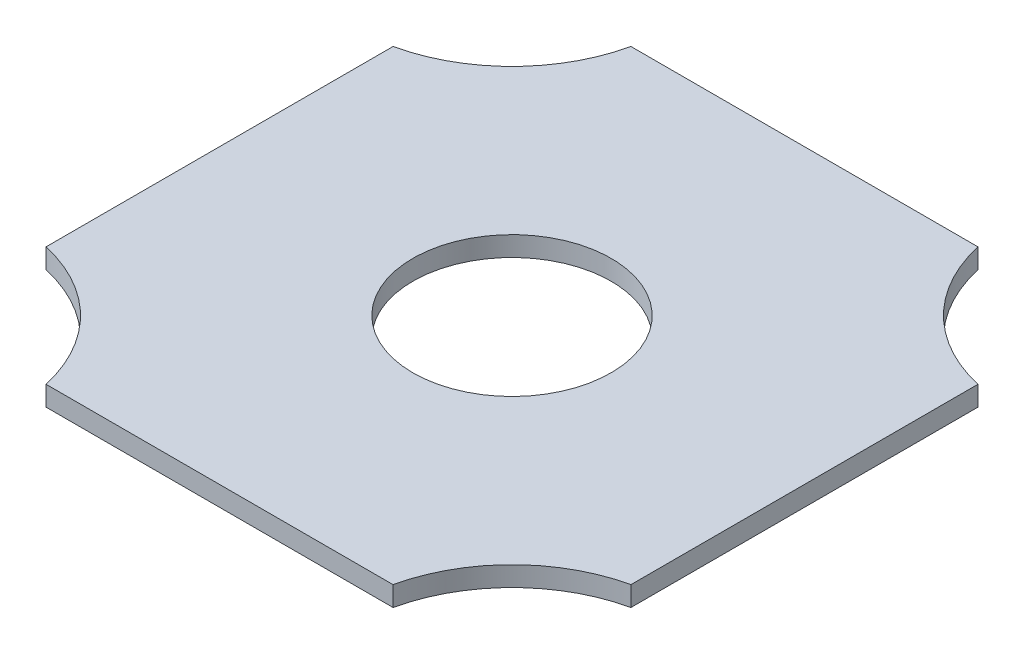
ISO-10303-21;
HEADER;
FILE_DESCRIPTION(('STEP AP214'),'2;1');
FILE_NAME('part.step','',(''),(''),'','','');
FILE_SCHEMA(('AUTOMOTIVE_DESIGN { 1 0 10303 214 1 1 1 1 }'));
ENDSEC;
DATA;
#1=APPLICATION_CONTEXT('core data for automotive mechanical design processes');
#2=APPLICATION_PROTOCOL_DEFINITION('international standard','automotive_design',2000,#1);
#3=PRODUCT_CONTEXT('',#1,'mechanical');
#4=PRODUCT('Part','Part','',(#3));
#5=PRODUCT_RELATED_PRODUCT_CATEGORY('part','',(#4));
#6=PRODUCT_DEFINITION_FORMATION('','',#4);
#7=PRODUCT_DEFINITION_CONTEXT('part definition',#1,'design');
#8=PRODUCT_DEFINITION('design','',#6,#7);
#9=PRODUCT_DEFINITION_SHAPE('','',#8);
#10=(LENGTH_UNIT() NAMED_UNIT(*) SI_UNIT(.MILLI.,.METRE.));
#11=(NAMED_UNIT(*) PLANE_ANGLE_UNIT() SI_UNIT($,.RADIAN.));
#12=(NAMED_UNIT(*) SI_UNIT($,.STERADIAN.) SOLID_ANGLE_UNIT());
#13=UNCERTAINTY_MEASURE_WITH_UNIT(LENGTH_MEASURE(1.E-05),#10,'distance_accuracy_value','');
#14=(GEOMETRIC_REPRESENTATION_CONTEXT(3) GLOBAL_UNCERTAINTY_ASSIGNED_CONTEXT((#13)) GLOBAL_UNIT_ASSIGNED_CONTEXT((#10,
#11,#12)) REPRESENTATION_CONTEXT('',''));
#15=CARTESIAN_POINT('',(0.,0.,0.));
#16=DIRECTION('',(0.,0.,1.));
#17=DIRECTION('',(1.,0.,0.));
#18=AXIS2_PLACEMENT_3D('',#15,#16,#17);
#19=CARTESIAN_POINT('',(-32.2270175622713,2.,-34.0017247818068));
#20=DIRECTION('',(0.,-1.,0.));
#21=DIRECTION('',(0.,0.,-1.));
#22=AXIS2_PLACEMENT_3D('',#19,#20,#21);
#23=CYLINDRICAL_SURFACE('',#22,15.8501875594606);
#24=CARTESIAN_POINT('',(-32.2270175622713,0.,-34.0017247818068));
#25=DIRECTION('',(0.,-1.,0.));
#26=DIRECTION('',(0.,0.,1.));
#27=AXIS2_PLACEMENT_3D('',#24,#25,#26);
#28=CIRCLE('',#27,15.8501875594606);
#29=CARTESIAN_POINT('',(-16.7605386585269,0.,-30.5352458780619));
#30=VERTEX_POINT('',#29);
#31=CARTESIAN_POINT('',(-28.760538658527,0.,-18.5352458780623));
#32=VERTEX_POINT('',#31);
#33=EDGE_CURVE('E140',#30,#32,#28,.T.);
#34=ORIENTED_EDGE('',*,*,#33,.T.);
#35=DIRECTION('',(0.,-1.,0.));
#36=VECTOR('',#35,1.);
#37=CARTESIAN_POINT('',(-28.760538658527,2.,-18.5352458780623));
#38=LINE('',#37,#36);
#39=CARTESIAN_POINT('',(-28.760538658527,2.,-18.5352458780623));
#40=VERTEX_POINT('',#39);
#41=EDGE_CURVE('E11',#40,#32,#38,.T.);
#42=ORIENTED_EDGE('',*,*,#41,.F.);
#43=CARTESIAN_POINT('',(-32.2270175622713,2.,-34.0017247818068));
#44=DIRECTION('',(0.,-1.,0.));
#45=DIRECTION('',(0.,0.,1.));
#46=AXIS2_PLACEMENT_3D('',#43,#44,#45);
#47=CIRCLE('',#46,15.8501875594606);
#48=CARTESIAN_POINT('',(-16.7605386585269,2.,-30.5352458780619));
#49=VERTEX_POINT('',#48);
#50=EDGE_CURVE('E154',#49,#40,#47,.T.);
#51=ORIENTED_EDGE('',*,*,#50,.F.);
#52=DIRECTION('',(0.,-1.,0.));
#53=VECTOR('',#52,1.);
#54=CARTESIAN_POINT('',(-16.7605386585269,2.,-30.5352458780619));
#55=LINE('',#54,#53);
#56=EDGE_CURVE('E136',#49,#30,#55,.T.);
#57=ORIENTED_EDGE('',*,*,#56,.T.);
#58=EDGE_LOOP('',(#34,#42,#51,#57));
#59=FACE_BOUND('',#58,.T.);
#60=ADVANCED_FACE('F43',(#59),#23,.F.);
#61=CARTESIAN_POINT('',(-28.760538658527,2.,-18.5352458780623));
#62=DIRECTION('',(1.,0.,0.));
#63=DIRECTION('',(0.,0.,-1.));
#64=AXIS2_PLACEMENT_3D('',#61,#62,#63);
#65=PLANE('',#64);
#66=DIRECTION('',(0.,0.,1.));
#67=VECTOR('',#66,1.);
#68=CARTESIAN_POINT('',(-28.760538658527,0.,-18.5352458780623));
#69=LINE('',#68,#67);
#70=CARTESIAN_POINT('',(-28.7605386585271,0.,16.4647541219377));
#71=VERTEX_POINT('',#70);
#72=EDGE_CURVE('E143',#32,#71,#69,.T.);
#73=ORIENTED_EDGE('',*,*,#72,.T.);
#74=DIRECTION('',(0.,-1.,0.));
#75=VECTOR('',#74,1.);
#76=CARTESIAN_POINT('',(-28.7605386585271,2.,16.4647541219377));
#77=LINE('',#76,#75);
#78=CARTESIAN_POINT('',(-28.7605386585271,2.,16.4647541219377));
#79=VERTEX_POINT('',#78);
#80=EDGE_CURVE('E52',#79,#71,#77,.T.);
#81=ORIENTED_EDGE('',*,*,#80,.F.);
#82=DIRECTION('',(0.,0.,1.));
#83=VECTOR('',#82,1.);
#84=CARTESIAN_POINT('',(-28.760538658527,2.,-18.5352458780623));
#85=LINE('',#84,#83);
#86=EDGE_CURVE('E103',#40,#79,#85,.T.);
#87=ORIENTED_EDGE('',*,*,#86,.F.);
#88=ORIENTED_EDGE('',*,*,#41,.T.);
#89=EDGE_LOOP('',(#73,#81,#87,#88));
#90=FACE_BOUND('',#89,.T.);
#91=ADVANCED_FACE('F205',(#90),#65,.F.);
#92=CARTESIAN_POINT('',(-32.2270175622719,2.,31.9312330256822));
#93=DIRECTION('',(0.,-1.,0.));
#94=DIRECTION('',(0.,0.,-1.));
#95=AXIS2_PLACEMENT_3D('',#92,#93,#94);
#96=CYLINDRICAL_SURFACE('',#95,15.8501875594607);
#97=CARTESIAN_POINT('',(-32.2270175622719,0.,31.9312330256822));
#98=DIRECTION('',(0.,-1.,0.));
#99=DIRECTION('',(0.,0.,1.));
#100=AXIS2_PLACEMENT_3D('',#97,#98,#99);
#101=CIRCLE('',#100,15.8501875594607);
#102=CARTESIAN_POINT('',(-16.7605386585272,0.,28.464754121938));
#103=VERTEX_POINT('',#102);
#104=EDGE_CURVE('E145',#71,#103,#101,.T.);
#105=ORIENTED_EDGE('',*,*,#104,.T.);
#106=DIRECTION('',(0.,-1.,0.));
#107=VECTOR('',#106,1.);
#108=CARTESIAN_POINT('',(-16.7605386585272,2.,28.464754121938));
#109=LINE('',#108,#107);
#110=CARTESIAN_POINT('',(-16.7605386585272,2.,28.464754121938));
#111=VERTEX_POINT('',#110);
#112=EDGE_CURVE('E161',#111,#103,#109,.T.);
#113=ORIENTED_EDGE('',*,*,#112,.F.);
#114=CARTESIAN_POINT('',(-32.2270175622719,2.,31.9312330256822));
#115=DIRECTION('',(0.,-1.,0.));
#116=DIRECTION('',(0.,0.,1.));
#117=AXIS2_PLACEMENT_3D('',#114,#115,#116);
#118=CIRCLE('',#117,15.8501875594607);
#119=EDGE_CURVE('E170',#79,#111,#118,.T.);
#120=ORIENTED_EDGE('',*,*,#119,.F.);
#121=ORIENTED_EDGE('',*,*,#80,.T.);
#122=EDGE_LOOP('',(#105,#113,#120,#121));
#123=FACE_BOUND('',#122,.T.);
#124=ADVANCED_FACE('F168',(#123),#96,.F.);
#125=CARTESIAN_POINT('',(-16.7605386585272,2.,28.464754121938));
#126=DIRECTION('',(0.,0.,-1.));
#127=DIRECTION('',(-1.,0.,0.));
#128=AXIS2_PLACEMENT_3D('',#125,#126,#127);
#129=PLANE('',#128);
#130=DIRECTION('',(1.,0.,0.));
#131=VECTOR('',#130,1.);
#132=CARTESIAN_POINT('',(-16.7605386585272,0.,28.464754121938));
#133=LINE('',#132,#131);
#134=CARTESIAN_POINT('',(18.2394613414727,0.,28.464754121938));
#135=VERTEX_POINT('',#134);
#136=EDGE_CURVE('E147',#103,#135,#133,.T.);
#137=ORIENTED_EDGE('',*,*,#136,.T.);
#138=DIRECTION('',(0.,-1.,0.));
#139=VECTOR('',#138,1.);
#140=CARTESIAN_POINT('',(18.2394613414727,2.,28.464754121938));
#141=LINE('',#140,#139);
#142=CARTESIAN_POINT('',(18.2394613414727,2.,28.464754121938));
#143=VERTEX_POINT('',#142);
#144=EDGE_CURVE('E158',#143,#135,#141,.T.);
#145=ORIENTED_EDGE('',*,*,#144,.F.);
#146=DIRECTION('',(1.,0.,0.));
#147=VECTOR('',#146,1.);
#148=CARTESIAN_POINT('',(-16.7605386585272,2.,28.464754121938));
#149=LINE('',#148,#147);
#150=EDGE_CURVE('E182',#111,#143,#149,.T.);
#151=ORIENTED_EDGE('',*,*,#150,.F.);
#152=ORIENTED_EDGE('',*,*,#112,.T.);
#153=EDGE_LOOP('',(#137,#145,#151,#152));
#154=FACE_BOUND('',#153,.T.);
#155=ADVANCED_FACE('F178',(#154),#129,.F.);
#156=CARTESIAN_POINT('',(33.7059402452171,2.,31.9312330256826));
#157=DIRECTION('',(0.,-1.,0.));
#158=DIRECTION('',(0.,0.,-1.));
#159=AXIS2_PLACEMENT_3D('',#156,#157,#158);
#160=CYLINDRICAL_SURFACE('',#159,15.8501875594606);
#161=CARTESIAN_POINT('',(33.7059402452171,0.,31.9312330256826));
#162=DIRECTION('',(0.,-1.,0.));
#163=DIRECTION('',(0.,0.,1.));
#164=AXIS2_PLACEMENT_3D('',#161,#162,#163);
#165=CIRCLE('',#164,15.8501875594606);
#166=CARTESIAN_POINT('',(30.2394613414728,0.,16.4647541219381));
#167=VERTEX_POINT('',#166);
#168=EDGE_CURVE('E149',#135,#167,#165,.T.);
#169=ORIENTED_EDGE('',*,*,#168,.T.);
#170=DIRECTION('',(0.,-1.,0.));
#171=VECTOR('',#170,1.);
#172=CARTESIAN_POINT('',(30.2394613414728,2.,16.4647541219381));
#173=LINE('',#172,#171);
#174=CARTESIAN_POINT('',(30.2394613414728,2.,16.4647541219381));
#175=VERTEX_POINT('',#174);
#176=EDGE_CURVE('E131',#175,#167,#173,.T.);
#177=ORIENTED_EDGE('',*,*,#176,.F.);
#178=CARTESIAN_POINT('',(33.7059402452171,2.,31.9312330256826));
#179=DIRECTION('',(0.,-1.,0.));
#180=DIRECTION('',(0.,0.,1.));
#181=AXIS2_PLACEMENT_3D('',#178,#179,#180);
#182=CIRCLE('',#181,15.8501875594606);
#183=EDGE_CURVE('E122',#143,#175,#182,.T.);
#184=ORIENTED_EDGE('',*,*,#183,.F.);
#185=ORIENTED_EDGE('',*,*,#144,.T.);
#186=EDGE_LOOP('',(#169,#177,#184,#185));
#187=FACE_BOUND('',#186,.T.);
#188=ADVANCED_FACE('F181',(#187),#160,.F.);
#189=CARTESIAN_POINT('',(30.2394613414728,2.,16.4647541219381));
#190=DIRECTION('',(-1.,0.,0.));
#191=DIRECTION('',(0.,0.,1.));
#192=AXIS2_PLACEMENT_3D('',#189,#190,#191);
#193=PLANE('',#192);
#194=DIRECTION('',(0.,0.,-1.));
#195=VECTOR('',#194,1.);
#196=CARTESIAN_POINT('',(30.2394613414728,0.,16.4647541219381));
#197=LINE('',#196,#195);
#198=CARTESIAN_POINT('',(30.2394613414728,0.,-18.5352458780619));
#199=VERTEX_POINT('',#198);
#200=EDGE_CURVE('E130',#167,#199,#197,.T.);
#201=ORIENTED_EDGE('',*,*,#200,.T.);
#202=DIRECTION('',(0.,-1.,0.));
#203=VECTOR('',#202,1.);
#204=CARTESIAN_POINT('',(30.2394613414728,2.,-18.5352458780619));
#205=LINE('',#204,#203);
#206=CARTESIAN_POINT('',(30.2394613414728,2.,-18.5352458780619));
#207=VERTEX_POINT('',#206);
#208=EDGE_CURVE('E127',#207,#199,#205,.T.);
#209=ORIENTED_EDGE('',*,*,#208,.F.);
#210=DIRECTION('',(0.,0.,-1.));
#211=VECTOR('',#210,1.);
#212=CARTESIAN_POINT('',(30.2394613414728,2.,16.4647541219381));
#213=LINE('',#212,#211);
#214=EDGE_CURVE('E116',#175,#207,#213,.T.);
#215=ORIENTED_EDGE('',*,*,#214,.F.);
#216=ORIENTED_EDGE('',*,*,#176,.T.);
#217=EDGE_LOOP('',(#201,#209,#215,#216));
#218=FACE_BOUND('',#217,.T.);
#219=ADVANCED_FACE('F128',(#218),#193,.F.);
#220=CARTESIAN_POINT('',(33.7059402452173,2.,-34.0017247818064));
#221=DIRECTION('',(0.,-1.,0.));
#222=DIRECTION('',(0.,0.,-1.));
#223=AXIS2_PLACEMENT_3D('',#220,#221,#222);
#224=CYLINDRICAL_SURFACE('',#223,15.8501875594607);
#225=CARTESIAN_POINT('',(33.7059402452173,0.,-34.0017247818064));
#226=DIRECTION('',(0.,-1.,0.));
#227=DIRECTION('',(0.,0.,1.));
#228=AXIS2_PLACEMENT_3D('',#225,#226,#227);
#229=CIRCLE('',#228,15.8501875594607);
#230=CARTESIAN_POINT('',(18.2394613414727,0.,-30.535245878062));
#231=VERTEX_POINT('',#230);
#232=EDGE_CURVE('E89',#199,#231,#229,.T.);
#233=ORIENTED_EDGE('',*,*,#232,.T.);
#234=DIRECTION('',(0.,-1.,0.));
#235=VECTOR('',#234,1.);
#236=CARTESIAN_POINT('',(18.2394613414727,2.,-30.535245878062));
#237=LINE('',#236,#235);
#238=CARTESIAN_POINT('',(18.2394613414727,2.,-30.535245878062));
#239=VERTEX_POINT('',#238);
#240=EDGE_CURVE('E132',#239,#231,#237,.T.);
#241=ORIENTED_EDGE('',*,*,#240,.F.);
#242=CARTESIAN_POINT('',(33.7059402452173,2.,-34.0017247818064));
#243=DIRECTION('',(0.,-1.,0.));
#244=DIRECTION('',(0.,0.,1.));
#245=AXIS2_PLACEMENT_3D('',#242,#243,#244);
#246=CIRCLE('',#245,15.8501875594607);
#247=EDGE_CURVE('E120',#207,#239,#246,.T.);
#248=ORIENTED_EDGE('',*,*,#247,.F.);
#249=ORIENTED_EDGE('',*,*,#208,.T.);
#250=EDGE_LOOP('',(#233,#241,#248,#249));
#251=FACE_BOUND('',#250,.T.);
#252=ADVANCED_FACE('F134',(#251),#224,.F.);
#253=CARTESIAN_POINT('',(18.2394613414727,2.,-30.535245878062));
#254=DIRECTION('',(0.,0.,1.));
#255=DIRECTION('',(1.,0.,0.));
#256=AXIS2_PLACEMENT_3D('',#253,#254,#255);
#257=PLANE('',#256);
#258=DIRECTION('',(-1.,0.,0.));
#259=VECTOR('',#258,1.);
#260=CARTESIAN_POINT('',(18.2394613414727,0.,-30.535245878062));
#261=LINE('',#260,#259);
#262=EDGE_CURVE('E95',#231,#30,#261,.T.);
#263=ORIENTED_EDGE('',*,*,#262,.T.);
#264=ORIENTED_EDGE('',*,*,#56,.F.);
#265=DIRECTION('',(-1.,0.,0.));
#266=VECTOR('',#265,1.);
#267=CARTESIAN_POINT('',(18.2394613414727,2.,-30.535245878062));
#268=LINE('',#267,#266);
#269=EDGE_CURVE('E60',#239,#49,#268,.T.);
#270=ORIENTED_EDGE('',*,*,#269,.F.);
#271=ORIENTED_EDGE('',*,*,#240,.T.);
#272=EDGE_LOOP('',(#263,#264,#270,#271));
#273=FACE_BOUND('',#272,.T.);
#274=ADVANCED_FACE('F212',(#273),#257,.F.);
#275=CARTESIAN_POINT('',(-32.2270175622713,2.,-34.0017247818068));
#276=DIRECTION('',(0.,1.,0.));
#277=DIRECTION('',(0.,0.,1.));
#278=AXIS2_PLACEMENT_3D('',#275,#276,#277);
#279=PLANE('',#278);
#280=CARTESIAN_POINT('',(0.73946134147285,2.,-1.03524587806197));
#281=DIRECTION('',(0.,1.,0.));
#282=DIRECTION('',(0.,0.,1.));
#283=AXIS2_PLACEMENT_3D('',#280,#281,#282);
#284=CIRCLE('',#283,10.);
#285=CARTESIAN_POINT('',(0.73946134147285,2.,8.96475412193803));
#286=VERTEX_POINT('',#285);
#287=EDGE_CURVE('E188',#286,#286,#284,.T.);
#288=ORIENTED_EDGE('',*,*,#287,.F.);
#289=EDGE_LOOP('',(#288));
#290=FACE_BOUND('',#289,.T.);
#291=ORIENTED_EDGE('',*,*,#50,.T.);
#292=ORIENTED_EDGE('',*,*,#86,.T.);
#293=ORIENTED_EDGE('',*,*,#119,.T.);
#294=ORIENTED_EDGE('',*,*,#150,.T.);
#295=ORIENTED_EDGE('',*,*,#183,.T.);
#296=ORIENTED_EDGE('',*,*,#214,.T.);
#297=ORIENTED_EDGE('',*,*,#247,.T.);
#298=ORIENTED_EDGE('',*,*,#269,.T.);
#299=EDGE_LOOP('',(#291,#292,#293,#294,#295,#296,#297,#298));
#300=FACE_BOUND('',#299,.T.);
#301=ADVANCED_FACE('F118',(#290,#300),#279,.T.);
#302=CARTESIAN_POINT('',(-32.2270175622713,0.,-34.0017247818068));
#303=DIRECTION('',(0.,1.,0.));
#304=DIRECTION('',(0.,0.,1.));
#305=AXIS2_PLACEMENT_3D('',#302,#303,#304);
#306=PLANE('',#305);
#307=CARTESIAN_POINT('',(0.73946134147285,0.,-1.03524587806197));
#308=DIRECTION('',(0.,1.,0.));
#309=DIRECTION('',(0.,0.,1.));
#310=AXIS2_PLACEMENT_3D('',#307,#308,#309);
#311=CIRCLE('',#310,10.);
#312=CARTESIAN_POINT('',(0.73946134147285,0.,8.96475412193803));
#313=VERTEX_POINT('',#312);
#314=EDGE_CURVE('E46',#313,#313,#311,.T.);
#315=ORIENTED_EDGE('',*,*,#314,.T.);
#316=EDGE_LOOP('',(#315));
#317=FACE_BOUND('',#316,.T.);
#318=ORIENTED_EDGE('',*,*,#33,.F.);
#319=ORIENTED_EDGE('',*,*,#262,.F.);
#320=ORIENTED_EDGE('',*,*,#232,.F.);
#321=ORIENTED_EDGE('',*,*,#200,.F.);
#322=ORIENTED_EDGE('',*,*,#168,.F.);
#323=ORIENTED_EDGE('',*,*,#136,.F.);
#324=ORIENTED_EDGE('',*,*,#104,.F.);
#325=ORIENTED_EDGE('',*,*,#72,.F.);
#326=EDGE_LOOP('',(#318,#319,#320,#321,#322,#323,#324,#325));
#327=FACE_BOUND('',#326,.T.);
#328=ADVANCED_FACE('F174',(#317,#327),#306,.F.);
#329=CARTESIAN_POINT('',(0.73946134147285,-1.,-1.03524587806197));
#330=DIRECTION('',(0.,1.,0.));
#331=DIRECTION('',(0.,0.,1.));
#332=AXIS2_PLACEMENT_3D('',#329,#330,#331);
#333=CYLINDRICAL_SURFACE('',#332,10.);
#334=ORIENTED_EDGE('',*,*,#287,.T.);
#335=EDGE_LOOP('',(#334));
#336=FACE_BOUND('',#335,.T.);
#337=ORIENTED_EDGE('',*,*,#314,.F.);
#338=EDGE_LOOP('',(#337));
#339=FACE_BOUND('',#338,.T.);
#340=ADVANCED_FACE('F196',(#336,#339),#333,.F.);
#341=CLOSED_SHELL('',(#60,#91,#124,#155,#188,#219,#252,#274,#301,#328,#340));
#342=MANIFOLD_SOLID_BREP('B2',#341);
#343=ADVANCED_BREP_SHAPE_REPRESENTATION('',(#18,#342),#14);
#344=SHAPE_DEFINITION_REPRESENTATION(#9,#343);
ENDSEC;
END-ISO-10303-21;
